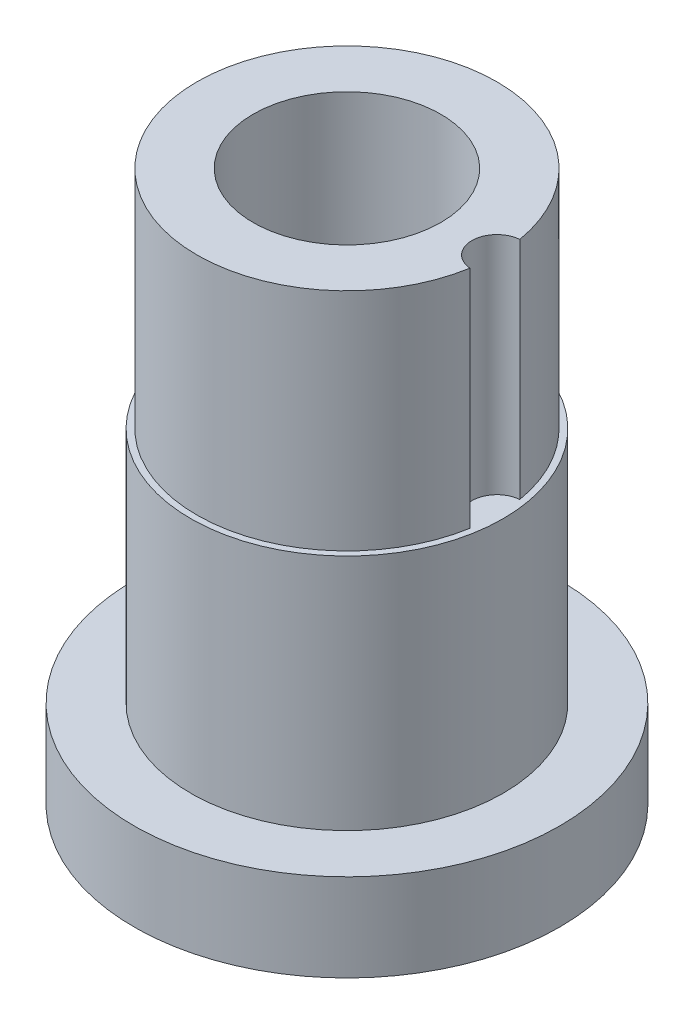
ISO-10303-21;
HEADER;
FILE_DESCRIPTION(('STEP AP214'),'2;1');
FILE_NAME('part.step','',(''),(''),'','','');
FILE_SCHEMA(('AUTOMOTIVE_DESIGN { 1 0 10303 214 1 1 1 1 }'));
ENDSEC;
DATA;
#1=APPLICATION_CONTEXT('core data for automotive mechanical design processes');
#2=APPLICATION_PROTOCOL_DEFINITION('international standard','automotive_design',2000,#1);
#3=PRODUCT_CONTEXT('',#1,'mechanical');
#4=PRODUCT('Part','Part','',(#3));
#5=PRODUCT_RELATED_PRODUCT_CATEGORY('part','',(#4));
#6=PRODUCT_DEFINITION_FORMATION('','',#4);
#7=PRODUCT_DEFINITION_CONTEXT('part definition',#1,'design');
#8=PRODUCT_DEFINITION('design','',#6,#7);
#9=PRODUCT_DEFINITION_SHAPE('','',#8);
#10=(LENGTH_UNIT() NAMED_UNIT(*) SI_UNIT(.MILLI.,.METRE.));
#11=(NAMED_UNIT(*) PLANE_ANGLE_UNIT() SI_UNIT($,.RADIAN.));
#12=(NAMED_UNIT(*) SI_UNIT($,.STERADIAN.) SOLID_ANGLE_UNIT());
#13=UNCERTAINTY_MEASURE_WITH_UNIT(LENGTH_MEASURE(1.E-05),#10,'distance_accuracy_value','');
#14=(GEOMETRIC_REPRESENTATION_CONTEXT(3) GLOBAL_UNCERTAINTY_ASSIGNED_CONTEXT((#13)) GLOBAL_UNIT_ASSIGNED_CONTEXT((#10,
#11,#12)) REPRESENTATION_CONTEXT('',''));
#15=CARTESIAN_POINT('',(0.,0.,0.));
#16=DIRECTION('',(0.,0.,1.));
#17=DIRECTION('',(1.,0.,0.));
#18=AXIS2_PLACEMENT_3D('',#15,#16,#17);
#19=CARTESIAN_POINT('',(0.,-34.925,0.));
#20=DIRECTION('',(0.,-1.,0.));
#21=DIRECTION('',(1.,0.,0.));
#22=AXIS2_PLACEMENT_3D('',#19,#20,#21);
#23=CYLINDRICAL_SURFACE('',#22,15.08125);
#24=CARTESIAN_POINT('',(0.,-34.925,0.));
#25=DIRECTION('',(0.,-1.,0.));
#26=DIRECTION('',(1.,0.,0.));
#27=AXIS2_PLACEMENT_3D('',#24,#25,#26);
#28=CIRCLE('',#27,15.08125);
#29=CARTESIAN_POINT('',(15.08125,-34.925,0.));
#30=VERTEX_POINT('',#29);
#31=EDGE_CURVE('E197',#30,#30,#28,.T.);
#32=ORIENTED_EDGE('',*,*,#31,.T.);
#33=EDGE_LOOP('',(#32));
#34=FACE_BOUND('',#33,.T.);
#35=CARTESIAN_POINT('',(0.,0.,0.));
#36=DIRECTION('',(0.,-1.,0.));
#37=DIRECTION('',(1.,0.,0.));
#38=AXIS2_PLACEMENT_3D('',#35,#36,#37);
#39=CIRCLE('',#38,15.08125);
#40=CARTESIAN_POINT('',(15.08125,0.,0.));
#41=VERTEX_POINT('',#40);
#42=EDGE_CURVE('E11',#41,#41,#39,.T.);
#43=ORIENTED_EDGE('',*,*,#42,.F.);
#44=EDGE_LOOP('',(#43));
#45=FACE_BOUND('',#44,.T.);
#46=ADVANCED_FACE('F33',(#34,#45),#23,.F.);
#47=CARTESIAN_POINT('',(0.,0.,0.));
#48=DIRECTION('',(0.,-1.,0.));
#49=DIRECTION('',(1.,0.,0.));
#50=AXIS2_PLACEMENT_3D('',#47,#48,#49);
#51=TOROIDAL_SURFACE('',#50,11.90625,3.175);
#52=ORIENTED_EDGE('',*,*,#42,.T.);
#53=EDGE_LOOP('',(#52));
#54=FACE_BOUND('',#53,.T.);
#55=CARTESIAN_POINT('',(0.,3.175,0.));
#56=DIRECTION('',(0.,-1.,0.));
#57=DIRECTION('',(1.,0.,0.));
#58=AXIS2_PLACEMENT_3D('',#55,#56,#57);
#59=CIRCLE('',#58,11.90625);
#60=CARTESIAN_POINT('',(11.90625,3.17500000000001,0.));
#61=VERTEX_POINT('',#60);
#62=EDGE_CURVE('E40',#61,#61,#59,.T.);
#63=ORIENTED_EDGE('',*,*,#62,.F.);
#64=EDGE_LOOP('',(#63));
#65=FACE_BOUND('',#64,.T.);
#66=ADVANCED_FACE('F88',(#54,#65),#51,.F.);
#67=CARTESIAN_POINT('',(0.,-34.925,0.));
#68=DIRECTION('',(0.,-1.,0.));
#69=DIRECTION('',(1.,0.,0.));
#70=AXIS2_PLACEMENT_3D('',#67,#68,#69);
#71=CYLINDRICAL_SURFACE('',#70,11.90625);
#72=ORIENTED_EDGE('',*,*,#62,.T.);
#73=EDGE_LOOP('',(#72));
#74=FACE_BOUND('',#73,.T.);
#75=CARTESIAN_POINT('',(0.,34.925,0.));
#76=DIRECTION('',(0.,-1.,0.));
#77=DIRECTION('',(1.,0.,0.));
#78=AXIS2_PLACEMENT_3D('',#75,#76,#77);
#79=CIRCLE('',#78,11.90625);
#80=CARTESIAN_POINT('',(11.90625,34.925,0.));
#81=VERTEX_POINT('',#80);
#82=EDGE_CURVE('E74',#81,#81,#79,.T.);
#83=ORIENTED_EDGE('',*,*,#82,.F.);
#84=EDGE_LOOP('',(#83));
#85=FACE_BOUND('',#84,.T.);
#86=ADVANCED_FACE('F85',(#74,#85),#71,.F.);
#87=CARTESIAN_POINT('',(19.0246,34.925,0.));
#88=DIRECTION('',(0.,1.,0.));
#89=DIRECTION('',(-1.,0.,0.));
#90=AXIS2_PLACEMENT_3D('',#87,#88,#89);
#91=PLANE('',#90);
#92=CARTESIAN_POINT('',(19.0246,34.925,0.));
#93=DIRECTION('',(0.,1.,0.));
#94=DIRECTION('',(-1.,0.,0.));
#95=AXIS2_PLACEMENT_3D('',#92,#93,#94);
#96=CIRCLE('',#95,3.175);
#97=CARTESIAN_POINT('',(18.7596634178905,34.925,-3.16392692827444));
#98=VERTEX_POINT('',#97);
#99=CARTESIAN_POINT('',(18.7596634178905,34.925,3.16392692827444));
#100=VERTEX_POINT('',#99);
#101=EDGE_CURVE('E62',#98,#100,#96,.T.);
#102=ORIENTED_EDGE('',*,*,#101,.F.);
#103=CARTESIAN_POINT('',(0.,34.925,0.));
#104=DIRECTION('',(0.,-1.,0.));
#105=DIRECTION('',(1.,0.,0.));
#106=AXIS2_PLACEMENT_3D('',#103,#104,#105);
#107=CIRCLE('',#106,19.0246);
#108=EDGE_CURVE('E69',#100,#98,#107,.T.);
#109=ORIENTED_EDGE('',*,*,#108,.F.);
#110=EDGE_LOOP('',(#102,#109));
#111=FACE_BOUND('',#110,.T.);
#112=ORIENTED_EDGE('',*,*,#82,.T.);
#113=EDGE_LOOP('',(#112));
#114=FACE_BOUND('',#113,.T.);
#115=ADVANCED_FACE('F95',(#111,#114),#91,.T.);
#116=CARTESIAN_POINT('',(0.,-34.925,0.));
#117=DIRECTION('',(0.,-1.,0.));
#118=DIRECTION('',(1.,0.,0.));
#119=AXIS2_PLACEMENT_3D('',#116,#117,#118);
#120=CYLINDRICAL_SURFACE('',#119,19.0246);
#121=DIRECTION('',(0.,1.,0.));
#122=VECTOR('',#121,1.);
#123=CARTESIAN_POINT('',(18.7596634178905,20.6375,3.16392692827444));
#124=LINE('',#123,#122);
#125=CARTESIAN_POINT('',(18.7596634178905,6.35,3.16392692827445));
#126=VERTEX_POINT('',#125);
#127=EDGE_CURVE('E60',#100,#126,#124,.F.);
#128=ORIENTED_EDGE('',*,*,#127,.F.);
#129=ORIENTED_EDGE('',*,*,#108,.T.);
#130=DIRECTION('',(0.,1.,0.));
#131=VECTOR('',#130,1.);
#132=CARTESIAN_POINT('',(18.7596634178905,20.6375,-3.16392692827444));
#133=LINE('',#132,#131);
#134=CARTESIAN_POINT('',(18.7596634178905,6.35,-3.16392692827444));
#135=VERTEX_POINT('',#134);
#136=EDGE_CURVE('E53',#135,#98,#133,.T.);
#137=ORIENTED_EDGE('',*,*,#136,.F.);
#138=CARTESIAN_POINT('',(0.,6.34999999999999,0.));
#139=DIRECTION('',(0.,-1.,0.));
#140=DIRECTION('',(1.,0.,0.));
#141=AXIS2_PLACEMENT_3D('',#138,#139,#140);
#142=CIRCLE('',#141,19.0246);
#143=EDGE_CURVE('E67',#126,#135,#142,.T.);
#144=ORIENTED_EDGE('',*,*,#143,.F.);
#145=EDGE_LOOP('',(#128,#129,#137,#144));
#146=FACE_BOUND('',#145,.T.);
#147=ADVANCED_FACE('F66',(#146),#120,.T.);
#148=CARTESIAN_POINT('',(19.0246,6.35,0.));
#149=DIRECTION('',(0.,1.,0.));
#150=DIRECTION('',(-1.,0.,0.));
#151=AXIS2_PLACEMENT_3D('',#148,#149,#150);
#152=PLANE('',#151);
#153=CARTESIAN_POINT('',(0.,6.34999999999999,0.));
#154=DIRECTION('',(0.,-1.,0.));
#155=DIRECTION('',(1.,0.,0.));
#156=AXIS2_PLACEMENT_3D('',#153,#154,#155);
#157=CIRCLE('',#156,19.812);
#158=CARTESIAN_POINT('',(19.812,6.34999999999999,0.));
#159=VERTEX_POINT('',#158);
#160=EDGE_CURVE('E72',#159,#159,#157,.T.);
#161=ORIENTED_EDGE('',*,*,#160,.F.);
#162=EDGE_LOOP('',(#161));
#163=FACE_BOUND('',#162,.T.);
#164=ORIENTED_EDGE('',*,*,#143,.T.);
#165=CARTESIAN_POINT('',(19.0246,6.35,0.));
#166=DIRECTION('',(0.,1.,0.));
#167=DIRECTION('',(-1.,0.,0.));
#168=AXIS2_PLACEMENT_3D('',#165,#166,#167);
#169=CIRCLE('',#168,3.175);
#170=EDGE_CURVE('E46',#126,#135,#169,.F.);
#171=ORIENTED_EDGE('',*,*,#170,.F.);
#172=EDGE_LOOP('',(#164,#171));
#173=FACE_BOUND('',#172,.T.);
#174=ADVANCED_FACE('F71',(#163,#173),#152,.T.);
#175=CARTESIAN_POINT('',(0.,-34.925,0.));
#176=DIRECTION('',(0.,-1.,0.));
#177=DIRECTION('',(1.,0.,0.));
#178=AXIS2_PLACEMENT_3D('',#175,#176,#177);
#179=CYLINDRICAL_SURFACE('',#178,19.812);
#180=ORIENTED_EDGE('',*,*,#160,.T.);
#181=EDGE_LOOP('',(#180));
#182=FACE_BOUND('',#181,.T.);
#183=CARTESIAN_POINT('',(0.,-23.8125,0.));
#184=DIRECTION('',(0.,-1.,0.));
#185=DIRECTION('',(1.,0.,0.));
#186=AXIS2_PLACEMENT_3D('',#183,#184,#185);
#187=CIRCLE('',#186,19.812);
#188=CARTESIAN_POINT('',(19.812,-23.8125,0.));
#189=VERTEX_POINT('',#188);
#190=EDGE_CURVE('E77',#189,#189,#187,.T.);
#191=ORIENTED_EDGE('',*,*,#190,.F.);
#192=EDGE_LOOP('',(#191));
#193=FACE_BOUND('',#192,.T.);
#194=ADVANCED_FACE('F106',(#182,#193),#179,.T.);
#195=CARTESIAN_POINT('',(26.9875,-23.8125,0.));
#196=DIRECTION('',(0.,1.,0.));
#197=DIRECTION('',(-1.,0.,0.));
#198=AXIS2_PLACEMENT_3D('',#195,#196,#197);
#199=PLANE('',#198);
#200=ORIENTED_EDGE('',*,*,#190,.T.);
#201=EDGE_LOOP('',(#200));
#202=FACE_BOUND('',#201,.T.);
#203=CARTESIAN_POINT('',(0.,-23.8125,0.));
#204=DIRECTION('',(0.,-1.,0.));
#205=DIRECTION('',(1.,0.,0.));
#206=AXIS2_PLACEMENT_3D('',#203,#204,#205);
#207=CIRCLE('',#206,26.9875);
#208=CARTESIAN_POINT('',(26.9875,-23.8125,0.));
#209=VERTEX_POINT('',#208);
#210=EDGE_CURVE('E199',#209,#209,#207,.T.);
#211=ORIENTED_EDGE('',*,*,#210,.F.);
#212=EDGE_LOOP('',(#211));
#213=FACE_BOUND('',#212,.T.);
#214=ADVANCED_FACE('F110',(#202,#213),#199,.T.);
#215=CARTESIAN_POINT('',(0.,-34.925,0.));
#216=DIRECTION('',(0.,-1.,0.));
#217=DIRECTION('',(1.,0.,0.));
#218=AXIS2_PLACEMENT_3D('',#215,#216,#217);
#219=CYLINDRICAL_SURFACE('',#218,26.9875);
#220=ORIENTED_EDGE('',*,*,#210,.T.);
#221=EDGE_LOOP('',(#220));
#222=FACE_BOUND('',#221,.T.);
#223=CARTESIAN_POINT('',(0.,-34.925,0.));
#224=DIRECTION('',(0.,-1.,0.));
#225=DIRECTION('',(1.,0.,0.));
#226=AXIS2_PLACEMENT_3D('',#223,#224,#225);
#227=CIRCLE('',#226,26.9875);
#228=CARTESIAN_POINT('',(26.9875,-34.925,0.));
#229=VERTEX_POINT('',#228);
#230=EDGE_CURVE('E194',#229,#229,#227,.T.);
#231=ORIENTED_EDGE('',*,*,#230,.F.);
#232=EDGE_LOOP('',(#231));
#233=FACE_BOUND('',#232,.T.);
#234=ADVANCED_FACE('F114',(#222,#233),#219,.T.);
#235=CARTESIAN_POINT('',(15.08125,-34.925,0.));
#236=DIRECTION('',(0.,-1.,0.));
#237=DIRECTION('',(1.,0.,0.));
#238=AXIS2_PLACEMENT_3D('',#235,#236,#237);
#239=PLANE('',#238);
#240=ORIENTED_EDGE('',*,*,#230,.T.);
#241=EDGE_LOOP('',(#240));
#242=FACE_BOUND('',#241,.T.);
#243=ORIENTED_EDGE('',*,*,#31,.F.);
#244=EDGE_LOOP('',(#243));
#245=FACE_BOUND('',#244,.T.);
#246=ADVANCED_FACE('F118',(#242,#245),#239,.T.);
#247=CARTESIAN_POINT('',(19.0246,-2.63025612106916,0.));
#248=DIRECTION('',(0.,1.,0.));
#249=DIRECTION('',(-1.,0.,0.));
#250=AXIS2_PLACEMENT_3D('',#247,#248,#249);
#251=CYLINDRICAL_SURFACE('',#250,3.175);
#252=ORIENTED_EDGE('',*,*,#127,.T.);
#253=ORIENTED_EDGE('',*,*,#170,.T.);
#254=ORIENTED_EDGE('',*,*,#136,.T.);
#255=ORIENTED_EDGE('',*,*,#101,.T.);
#256=EDGE_LOOP('',(#252,#253,#254,#255));
#257=FACE_BOUND('',#256,.T.);
#258=ADVANCED_FACE('F58',(#257),#251,.F.);
#259=CLOSED_SHELL('',(#46,#66,#86,#115,#147,#174,#194,#214,#234,#246,#258));
#260=MANIFOLD_SOLID_BREP('B2',#259);
#261=ADVANCED_BREP_SHAPE_REPRESENTATION('',(#18,#260),#14);
#262=SHAPE_DEFINITION_REPRESENTATION(#9,#261);
ENDSEC;
END-ISO-10303-21;
